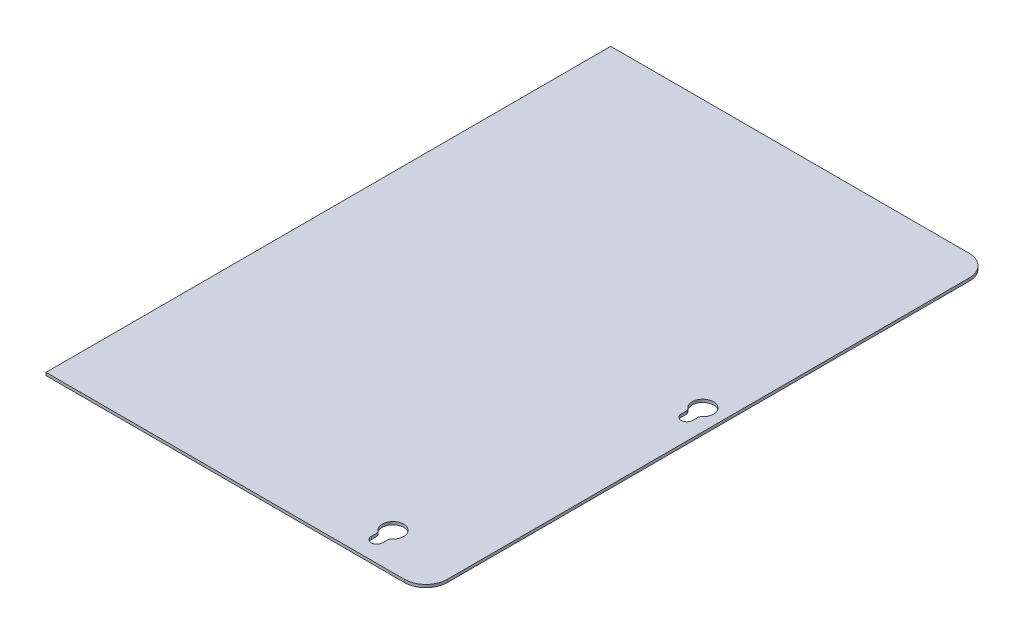
ISO-10303-21;
HEADER;
FILE_DESCRIPTION(('STEP AP214'),'2;1');
FILE_NAME('part.step','',(''),(''),'','','');
FILE_SCHEMA(('AUTOMOTIVE_DESIGN { 1 0 10303 214 1 1 1 1 }'));
ENDSEC;
DATA;
#1=APPLICATION_CONTEXT('core data for automotive mechanical design processes');
#2=APPLICATION_PROTOCOL_DEFINITION('international standard','automotive_design',2000,#1);
#3=PRODUCT_CONTEXT('',#1,'mechanical');
#4=PRODUCT('Part','Part','',(#3));
#5=PRODUCT_RELATED_PRODUCT_CATEGORY('part','',(#4));
#6=PRODUCT_DEFINITION_FORMATION('','',#4);
#7=PRODUCT_DEFINITION_CONTEXT('part definition',#1,'design');
#8=PRODUCT_DEFINITION('design','',#6,#7);
#9=PRODUCT_DEFINITION_SHAPE('','',#8);
#10=(LENGTH_UNIT() NAMED_UNIT(*) SI_UNIT(.MILLI.,.METRE.));
#11=(NAMED_UNIT(*) PLANE_ANGLE_UNIT() SI_UNIT($,.RADIAN.));
#12=(NAMED_UNIT(*) SI_UNIT($,.STERADIAN.) SOLID_ANGLE_UNIT());
#13=UNCERTAINTY_MEASURE_WITH_UNIT(LENGTH_MEASURE(1.E-05),#10,'distance_accuracy_value','');
#14=(GEOMETRIC_REPRESENTATION_CONTEXT(3) GLOBAL_UNCERTAINTY_ASSIGNED_CONTEXT((#13)) GLOBAL_UNIT_ASSIGNED_CONTEXT((#10,
#11,#12)) REPRESENTATION_CONTEXT('',''));
#15=CARTESIAN_POINT('',(0.,0.,0.));
#16=DIRECTION('',(0.,0.,1.));
#17=DIRECTION('',(1.,0.,0.));
#18=AXIS2_PLACEMENT_3D('',#15,#16,#17);
#19=CARTESIAN_POINT('',(139.91438841181,-62.325404639113,-67.8335757825874));
#20=DIRECTION('',(0.,0.,1.));
#21=DIRECTION('',(0.,-1.,0.));
#22=AXIS2_PLACEMENT_3D('',#19,#20,#21);
#23=PLANE('',#22);
#24=DIRECTION('',(1.,0.,0.));
#25=VECTOR('',#24,1.);
#26=CARTESIAN_POINT('',(139.91438841181,-63.655404639113,-67.8335757825874));
#27=LINE('',#26,#25);
#28=CARTESIAN_POINT('',(297.802816543447,-63.6554046391145,-67.8335757825874));
#29=VERTEX_POINT('',#28);
#30=CARTESIAN_POINT('',(130.428149664493,-63.6554046391129,-67.8335757825874));
#31=VERTEX_POINT('',#30);
#32=EDGE_CURVE('E63',#29,#31,#27,.F.);
#33=ORIENTED_EDGE('',*,*,#32,.T.);
#34=DIRECTION('',(0.,1.,0.));
#35=VECTOR('',#34,1.);
#36=CARTESIAN_POINT('',(130.428149664493,-62.3254046391128,-67.8335757825874));
#37=LINE('',#36,#35);
#38=CARTESIAN_POINT('',(130.428149664493,-62.3254046391128,-67.8335757825874));
#39=VERTEX_POINT('',#38);
#40=EDGE_CURVE('E320',#31,#39,#37,.T.);
#41=ORIENTED_EDGE('',*,*,#40,.T.);
#42=DIRECTION('',(-1.,0.,0.));
#43=VECTOR('',#42,1.);
#44=CARTESIAN_POINT('',(192.574388411811,-62.3254046391138,-67.8335757825874));
#45=LINE('',#44,#43);
#46=CARTESIAN_POINT('',(297.802816543447,-62.3254046391145,-67.8335757825874));
#47=VERTEX_POINT('',#46);
#48=EDGE_CURVE('E69',#47,#39,#45,.T.);
#49=ORIENTED_EDGE('',*,*,#48,.F.);
#50=DIRECTION('',(0.,-1.,0.));
#51=VECTOR('',#50,1.);
#52=CARTESIAN_POINT('',(297.802816543447,-62.3254046391145,-67.8335757825874));
#53=LINE('',#52,#51);
#54=EDGE_CURVE('E208',#47,#29,#53,.T.);
#55=ORIENTED_EDGE('',*,*,#54,.T.);
#56=EDGE_LOOP('',(#33,#41,#49,#55));
#57=FACE_BOUND('',#56,.T.);
#58=ADVANCED_FACE('F59',(#57),#23,.F.);
#59=CARTESIAN_POINT('',(192.574388411811,-62.3254046391138,195.847585533979));
#60=DIRECTION('',(0.,0.,-1.));
#61=DIRECTION('',(0.,1.,0.));
#62=AXIS2_PLACEMENT_3D('',#59,#60,#61);
#63=PLANE('',#62);
#64=DIRECTION('',(1.,0.,0.));
#65=VECTOR('',#64,1.);
#66=CARTESIAN_POINT('',(192.574388411811,-62.3254046391138,195.847585533979));
#67=LINE('',#66,#65);
#68=CARTESIAN_POINT('',(130.428149664493,-62.3254046391128,195.847585533979));
#69=VERTEX_POINT('',#68);
#70=CARTESIAN_POINT('',(297.802816543447,-62.3254046391145,195.847585533979));
#71=VERTEX_POINT('',#70);
#72=EDGE_CURVE('E13',#69,#71,#67,.T.);
#73=ORIENTED_EDGE('',*,*,#72,.F.);
#74=DIRECTION('',(0.,1.,0.));
#75=VECTOR('',#74,1.);
#76=CARTESIAN_POINT('',(130.428149664493,-62.3254046391128,195.847585533979));
#77=LINE('',#76,#75);
#78=CARTESIAN_POINT('',(130.428149664493,-63.6554046391129,195.847585533979));
#79=VERTEX_POINT('',#78);
#80=EDGE_CURVE('E212',#79,#69,#77,.T.);
#81=ORIENTED_EDGE('',*,*,#80,.F.);
#82=DIRECTION('',(-1.,0.,0.));
#83=VECTOR('',#82,1.);
#84=CARTESIAN_POINT('',(192.574388411811,-63.6554046391138,195.847585533979));
#85=LINE('',#84,#83);
#86=CARTESIAN_POINT('',(297.802816543447,-63.6554046391145,195.847585533979));
#87=VERTEX_POINT('',#86);
#88=EDGE_CURVE('E78',#79,#87,#85,.F.);
#89=ORIENTED_EDGE('',*,*,#88,.T.);
#90=DIRECTION('',(0.,-1.,0.));
#91=VECTOR('',#90,1.);
#92=CARTESIAN_POINT('',(297.802816543447,-62.3254046391145,195.847585533979));
#93=LINE('',#92,#91);
#94=EDGE_CURVE('E310',#71,#87,#93,.T.);
#95=ORIENTED_EDGE('',*,*,#94,.F.);
#96=EDGE_LOOP('',(#73,#81,#89,#95));
#97=FACE_BOUND('',#96,.T.);
#98=ADVANCED_FACE('F324',(#97),#63,.F.);
#99=CARTESIAN_POINT('',(297.802816543447,-62.3254046391145,-57.8335757825874));
#100=DIRECTION('',(0.,1.,0.));
#101=DIRECTION('',(-1.,0.,0.));
#102=AXIS2_PLACEMENT_3D('',#99,#100,#101);
#103=PLANE('',#102);
#104=ORIENTED_EDGE('',*,*,#48,.T.);
#105=DIRECTION('',(0.,0.,-1.));
#106=VECTOR('',#105,1.);
#107=CARTESIAN_POINT('',(130.428149664493,-62.3254046391128,64.0070048756957));
#108=LINE('',#107,#106);
#109=EDGE_CURVE('E214',#69,#39,#108,.T.);
#110=ORIENTED_EDGE('',*,*,#109,.F.);
#111=ORIENTED_EDGE('',*,*,#72,.T.);
#112=CARTESIAN_POINT('',(297.802816543447,-62.3254046391145,185.847585533979));
#113=DIRECTION('',(0.,1.,0.));
#114=DIRECTION('',(-1.,0.,0.));
#115=AXIS2_PLACEMENT_3D('',#112,#113,#114);
#116=CIRCLE('',#115,10.);
#117=CARTESIAN_POINT('',(307.802816543447,-62.3254046391146,185.847585533979));
#118=VERTEX_POINT('',#117);
#119=EDGE_CURVE('E232',#71,#118,#116,.T.);
#120=ORIENTED_EDGE('',*,*,#119,.T.);
#121=DIRECTION('',(0.,0.,-1.));
#122=VECTOR('',#121,1.);
#123=CARTESIAN_POINT('',(307.802816543447,-62.3254046391146,185.847585533979));
#124=LINE('',#123,#122);
#125=CARTESIAN_POINT('',(307.802816543447,-62.3254046391146,-57.8335757825874));
#126=VERTEX_POINT('',#125);
#127=EDGE_CURVE('E230',#118,#126,#124,.T.);
#128=ORIENTED_EDGE('',*,*,#127,.T.);
#129=CARTESIAN_POINT('',(297.802816543447,-62.3254046391145,-57.8335757825874));
#130=DIRECTION('',(0.,1.,0.));
#131=DIRECTION('',(-1.,0.,0.));
#132=AXIS2_PLACEMENT_3D('',#129,#130,#131);
#133=CIRCLE('',#132,9.99999999999998);
#134=EDGE_CURVE('E228',#126,#47,#133,.T.);
#135=ORIENTED_EDGE('',*,*,#134,.T.);
#136=EDGE_LOOP('',(#104,#110,#111,#120,#128,#135));
#137=FACE_BOUND('',#136,.T.);
#138=CARTESIAN_POINT('',(298.171116543447,-62.3254046391145,56.8753048756958));
#139=DIRECTION('',(0.,1.,0.));
#140=DIRECTION('',(-1.,0.,0.));
#141=AXIS2_PLACEMENT_3D('',#138,#139,#140);
#142=CIRCLE('',#141,4.99999999999999);
#143=CARTESIAN_POINT('',(301.474687972018,-62.3254046391146,60.6284922965857));
#144=VERTEX_POINT('',#143);
#145=CARTESIAN_POINT('',(294.867545114875,-62.3254046391145,60.6284922965857));
#146=VERTEX_POINT('',#145);
#147=EDGE_CURVE('E250',#144,#146,#142,.T.);
#148=ORIENTED_EDGE('',*,*,#147,.F.);
#149=CARTESIAN_POINT('',(302.796116543447,-62.3254046391146,62.1297672649417));
#150=DIRECTION('',(0.,1.,0.));
#151=DIRECTION('',(-1.,0.,0.));
#152=AXIS2_PLACEMENT_3D('',#149,#150,#151);
#153=CIRCLE('',#152,2.);
#154=CARTESIAN_POINT('',(300.796116543447,-62.3254046391146,62.1297672649417));
#155=VERTEX_POINT('',#154);
#156=EDGE_CURVE('E246',#144,#155,#153,.T.);
#157=ORIENTED_EDGE('',*,*,#156,.T.);
#158=DIRECTION('',(0.,0.,-1.));
#159=VECTOR('',#158,1.);
#160=CARTESIAN_POINT('',(300.796116543447,-62.3254046391146,64.0070048756958));
#161=LINE('',#160,#159);
#162=CARTESIAN_POINT('',(300.796116543447,-62.3254046391146,64.3753048756958));
#163=VERTEX_POINT('',#162);
#164=EDGE_CURVE('E265',#163,#155,#161,.T.);
#165=ORIENTED_EDGE('',*,*,#164,.F.);
#166=CARTESIAN_POINT('',(298.171116543447,-62.3254046391145,64.3753048756958));
#167=DIRECTION('',(0.,1.,0.));
#168=DIRECTION('',(-1.,0.,0.));
#169=AXIS2_PLACEMENT_3D('',#166,#167,#168);
#170=CIRCLE('',#169,2.62499999999999);
#171=CARTESIAN_POINT('',(295.546116543447,-62.3254046391145,64.3753048756958));
#172=VERTEX_POINT('',#171);
#173=EDGE_CURVE('E268',#172,#163,#170,.T.);
#174=ORIENTED_EDGE('',*,*,#173,.F.);
#175=DIRECTION('',(0.,0.,-1.));
#176=VECTOR('',#175,1.);
#177=CARTESIAN_POINT('',(295.546116543447,-62.3254046391145,64.0070048756958));
#178=LINE('',#177,#176);
#179=CARTESIAN_POINT('',(295.546116543447,-62.3254046391145,62.1297672649417));
#180=VERTEX_POINT('',#179);
#181=EDGE_CURVE('E243',#172,#180,#178,.T.);
#182=ORIENTED_EDGE('',*,*,#181,.T.);
#183=CARTESIAN_POINT('',(293.546116543447,-62.3254046391145,62.1297672649417));
#184=DIRECTION('',(0.,1.,0.));
#185=DIRECTION('',(-1.,0.,0.));
#186=AXIS2_PLACEMENT_3D('',#183,#184,#185);
#187=CIRCLE('',#186,2.);
#188=EDGE_CURVE('E241',#180,#146,#187,.T.);
#189=ORIENTED_EDGE('',*,*,#188,.T.);
#190=EDGE_LOOP('',(#148,#157,#165,#174,#182,#189));
#191=FACE_BOUND('',#190,.T.);
#192=CARTESIAN_POINT('',(275.302816543447,-62.3254046391144,178.715885533979));
#193=DIRECTION('',(0.,1.,0.));
#194=DIRECTION('',(-1.,0.,0.));
#195=AXIS2_PLACEMENT_3D('',#192,#193,#194);
#196=CIRCLE('',#195,4.99999999999999);
#197=CARTESIAN_POINT('',(278.606387972018,-62.3254046391144,182.469072954869));
#198=VERTEX_POINT('',#197);
#199=CARTESIAN_POINT('',(271.999245114875,-62.3254046391143,182.469072954869));
#200=VERTEX_POINT('',#199);
#201=EDGE_CURVE('E281',#198,#200,#196,.T.);
#202=ORIENTED_EDGE('',*,*,#201,.F.);
#203=CARTESIAN_POINT('',(279.927816543447,-62.3254046391144,183.970347923225));
#204=DIRECTION('',(0.,1.,0.));
#205=DIRECTION('',(-1.,0.,0.));
#206=AXIS2_PLACEMENT_3D('',#203,#204,#205);
#207=CIRCLE('',#206,2.);
#208=CARTESIAN_POINT('',(277.927816543447,-62.3254046391144,183.970347923225));
#209=VERTEX_POINT('',#208);
#210=EDGE_CURVE('E239',#198,#209,#207,.T.);
#211=ORIENTED_EDGE('',*,*,#210,.T.);
#212=DIRECTION('',(0.,0.,-1.));
#213=VECTOR('',#212,1.);
#214=CARTESIAN_POINT('',(277.927816543447,-62.3254046391144,64.0070048756976));
#215=LINE('',#214,#213);
#216=CARTESIAN_POINT('',(277.927816543447,-62.3254046391144,186.215885533979));
#217=VERTEX_POINT('',#216);
#218=EDGE_CURVE('E296',#217,#209,#215,.T.);
#219=ORIENTED_EDGE('',*,*,#218,.F.);
#220=CARTESIAN_POINT('',(275.302816543447,-62.3254046391144,186.215885533979));
#221=DIRECTION('',(0.,1.,0.));
#222=DIRECTION('',(-1.,0.,0.));
#223=AXIS2_PLACEMENT_3D('',#220,#221,#222);
#224=CIRCLE('',#223,2.62499999999999);
#225=CARTESIAN_POINT('',(272.677816543447,-62.3254046391143,186.215885533979));
#226=VERTEX_POINT('',#225);
#227=EDGE_CURVE('E299',#226,#217,#224,.T.);
#228=ORIENTED_EDGE('',*,*,#227,.F.);
#229=DIRECTION('',(0.,0.,-1.));
#230=VECTOR('',#229,1.);
#231=CARTESIAN_POINT('',(272.677816543446,-62.3254046391143,64.0070048756939));
#232=LINE('',#231,#230);
#233=CARTESIAN_POINT('',(272.677816543447,-62.3254046391143,183.970347923225));
#234=VERTEX_POINT('',#233);
#235=EDGE_CURVE('E236',#226,#234,#232,.T.);
#236=ORIENTED_EDGE('',*,*,#235,.T.);
#237=CARTESIAN_POINT('',(270.677816543447,-62.3254046391143,183.970347923225));
#238=DIRECTION('',(0.,1.,0.));
#239=DIRECTION('',(-1.,0.,0.));
#240=AXIS2_PLACEMENT_3D('',#237,#238,#239);
#241=CIRCLE('',#240,2.);
#242=EDGE_CURVE('E234',#234,#200,#241,.T.);
#243=ORIENTED_EDGE('',*,*,#242,.T.);
#244=EDGE_LOOP('',(#202,#211,#219,#228,#236,#243));
#245=FACE_BOUND('',#244,.T.);
#246=ADVANCED_FACE('F61',(#137,#191,#245),#103,.T.);
#247=CARTESIAN_POINT('',(192.574388411811,-63.6554046391138,195.847585533979));
#248=DIRECTION('',(0.,-1.,0.));
#249=DIRECTION('',(1.,0.,0.));
#250=AXIS2_PLACEMENT_3D('',#247,#248,#249);
#251=PLANE('',#250);
#252=ORIENTED_EDGE('',*,*,#88,.F.);
#253=DIRECTION('',(0.,0.,1.));
#254=VECTOR('',#253,1.);
#255=CARTESIAN_POINT('',(130.428149664493,-63.6554046391129,64.0070048756957));
#256=LINE('',#255,#254);
#257=EDGE_CURVE('E203',#79,#31,#256,.F.);
#258=ORIENTED_EDGE('',*,*,#257,.T.);
#259=ORIENTED_EDGE('',*,*,#32,.F.);
#260=CARTESIAN_POINT('',(297.802816543447,-63.6554046391145,-57.8335757825874));
#261=DIRECTION('',(0.,1.,0.));
#262=DIRECTION('',(-1.,0.,0.));
#263=AXIS2_PLACEMENT_3D('',#260,#261,#262);
#264=CIRCLE('',#263,9.99999999999998);
#265=CARTESIAN_POINT('',(307.802816543447,-63.6554046391146,-57.8335757825874));
#266=VERTEX_POINT('',#265);
#267=EDGE_CURVE('E201',#266,#29,#264,.T.);
#268=ORIENTED_EDGE('',*,*,#267,.F.);
#269=DIRECTION('',(0.,0.,-1.));
#270=VECTOR('',#269,1.);
#271=CARTESIAN_POINT('',(307.802816543447,-63.6554046391146,185.847585533979));
#272=LINE('',#271,#270);
#273=CARTESIAN_POINT('',(307.802816543447,-63.6554046391146,185.847585533979));
#274=VERTEX_POINT('',#273);
#275=EDGE_CURVE('E195',#274,#266,#272,.T.);
#276=ORIENTED_EDGE('',*,*,#275,.F.);
#277=CARTESIAN_POINT('',(297.802816543447,-63.6554046391145,185.847585533979));
#278=DIRECTION('',(0.,1.,0.));
#279=DIRECTION('',(-1.,0.,0.));
#280=AXIS2_PLACEMENT_3D('',#277,#278,#279);
#281=CIRCLE('',#280,10.);
#282=EDGE_CURVE('E313',#87,#274,#281,.T.);
#283=ORIENTED_EDGE('',*,*,#282,.F.);
#284=EDGE_LOOP('',(#252,#258,#259,#268,#276,#283));
#285=FACE_BOUND('',#284,.T.);
#286=DIRECTION('',(0.,0.,1.));
#287=VECTOR('',#286,1.);
#288=CARTESIAN_POINT('',(300.796116543447,-63.6554046391146,64.0070048756958));
#289=LINE('',#288,#287);
#290=CARTESIAN_POINT('',(300.796116543447,-63.6554046391146,62.1297672649417));
#291=VERTEX_POINT('',#290);
#292=CARTESIAN_POINT('',(300.796116543447,-63.6554046391145,64.3753048756958));
#293=VERTEX_POINT('',#292);
#294=EDGE_CURVE('E261',#291,#293,#289,.T.);
#295=ORIENTED_EDGE('',*,*,#294,.F.);
#296=CARTESIAN_POINT('',(302.796116543447,-63.6554046391146,62.1297672649417));
#297=DIRECTION('',(0.,1.,0.));
#298=DIRECTION('',(-1.,0.,0.));
#299=AXIS2_PLACEMENT_3D('',#296,#297,#298);
#300=CIRCLE('',#299,2.);
#301=CARTESIAN_POINT('',(301.474687972018,-63.6554046391146,60.6284922965857));
#302=VERTEX_POINT('',#301);
#303=EDGE_CURVE('E226',#291,#302,#300,.F.);
#304=ORIENTED_EDGE('',*,*,#303,.T.);
#305=CARTESIAN_POINT('',(298.171116543447,-63.6554046391145,56.8753048756958));
#306=DIRECTION('',(0.,1.,0.));
#307=DIRECTION('',(-1.,0.,0.));
#308=AXIS2_PLACEMENT_3D('',#305,#306,#307);
#309=CIRCLE('',#308,4.99999999999999);
#310=CARTESIAN_POINT('',(294.867545114875,-63.6554046391145,60.6284922965857));
#311=VERTEX_POINT('',#310);
#312=EDGE_CURVE('E256',#311,#302,#309,.F.);
#313=ORIENTED_EDGE('',*,*,#312,.F.);
#314=CARTESIAN_POINT('',(293.546116543447,-63.6554046391145,62.1297672649417));
#315=DIRECTION('',(0.,1.,0.));
#316=DIRECTION('',(-1.,0.,0.));
#317=AXIS2_PLACEMENT_3D('',#314,#315,#316);
#318=CIRCLE('',#317,2.);
#319=CARTESIAN_POINT('',(295.546116543447,-63.6554046391145,62.1297672649417));
#320=VERTEX_POINT('',#319);
#321=EDGE_CURVE('E224',#311,#320,#318,.F.);
#322=ORIENTED_EDGE('',*,*,#321,.T.);
#323=DIRECTION('',(0.,0.,1.));
#324=VECTOR('',#323,1.);
#325=CARTESIAN_POINT('',(295.546116543447,-63.6554046391145,64.0070048756958));
#326=LINE('',#325,#324);
#327=CARTESIAN_POINT('',(295.546116543447,-63.6554046391145,64.3753048756958));
#328=VERTEX_POINT('',#327);
#329=EDGE_CURVE('E222',#320,#328,#326,.T.);
#330=ORIENTED_EDGE('',*,*,#329,.T.);
#331=CARTESIAN_POINT('',(298.171116543447,-63.6554046391145,64.3753048756958));
#332=DIRECTION('',(0.,1.,0.));
#333=DIRECTION('',(-1.,0.,0.));
#334=AXIS2_PLACEMENT_3D('',#331,#332,#333);
#335=CIRCLE('',#334,2.62499999999999);
#336=EDGE_CURVE('E273',#293,#328,#335,.F.);
#337=ORIENTED_EDGE('',*,*,#336,.F.);
#338=EDGE_LOOP('',(#295,#304,#313,#322,#330,#337));
#339=FACE_BOUND('',#338,.T.);
#340=DIRECTION('',(0.,0.,1.));
#341=VECTOR('',#340,1.);
#342=CARTESIAN_POINT('',(277.927816543447,-63.6554046391144,64.0070048756976));
#343=LINE('',#342,#341);
#344=CARTESIAN_POINT('',(277.927816543447,-63.6554046391144,183.970347923225));
#345=VERTEX_POINT('',#344);
#346=CARTESIAN_POINT('',(277.927816543447,-63.6554046391144,186.215885533979));
#347=VERTEX_POINT('',#346);
#348=EDGE_CURVE('E292',#345,#347,#343,.T.);
#349=ORIENTED_EDGE('',*,*,#348,.F.);
#350=CARTESIAN_POINT('',(279.927816543447,-63.6554046391144,183.970347923225));
#351=DIRECTION('',(0.,1.,0.));
#352=DIRECTION('',(-1.,0.,0.));
#353=AXIS2_PLACEMENT_3D('',#350,#351,#352);
#354=CIRCLE('',#353,2.);
#355=CARTESIAN_POINT('',(278.606387972018,-63.6554046391144,182.469072954869));
#356=VERTEX_POINT('',#355);
#357=EDGE_CURVE('E220',#345,#356,#354,.F.);
#358=ORIENTED_EDGE('',*,*,#357,.T.);
#359=CARTESIAN_POINT('',(275.302816543447,-63.6554046391144,178.715885533979));
#360=DIRECTION('',(0.,1.,0.));
#361=DIRECTION('',(-1.,0.,0.));
#362=AXIS2_PLACEMENT_3D('',#359,#360,#361);
#363=CIRCLE('',#362,4.99999999999999);
#364=CARTESIAN_POINT('',(271.999245114875,-63.6554046391143,182.469072954869));
#365=VERTEX_POINT('',#364);
#366=EDGE_CURVE('E287',#365,#356,#363,.F.);
#367=ORIENTED_EDGE('',*,*,#366,.F.);
#368=CARTESIAN_POINT('',(270.677816543447,-63.6554046391143,183.970347923225));
#369=DIRECTION('',(0.,1.,0.));
#370=DIRECTION('',(-1.,0.,0.));
#371=AXIS2_PLACEMENT_3D('',#368,#369,#370);
#372=CIRCLE('',#371,2.);
#373=CARTESIAN_POINT('',(272.677816543447,-63.6554046391143,183.970347923225));
#374=VERTEX_POINT('',#373);
#375=EDGE_CURVE('E216',#365,#374,#372,.F.);
#376=ORIENTED_EDGE('',*,*,#375,.T.);
#377=DIRECTION('',(0.,0.,1.));
#378=VECTOR('',#377,1.);
#379=CARTESIAN_POINT('',(272.677816543446,-63.6554046391143,64.0070048756939));
#380=LINE('',#379,#378);
#381=CARTESIAN_POINT('',(272.677816543447,-63.6554046391143,186.215885533979));
#382=VERTEX_POINT('',#381);
#383=EDGE_CURVE('E104',#374,#382,#380,.T.);
#384=ORIENTED_EDGE('',*,*,#383,.T.);
#385=CARTESIAN_POINT('',(275.302816543447,-63.6554046391144,186.215885533979));
#386=DIRECTION('',(0.,1.,0.));
#387=DIRECTION('',(-1.,0.,0.));
#388=AXIS2_PLACEMENT_3D('',#385,#386,#387);
#389=CIRCLE('',#388,2.62499999999999);
#390=EDGE_CURVE('E304',#347,#382,#389,.F.);
#391=ORIENTED_EDGE('',*,*,#390,.F.);
#392=EDGE_LOOP('',(#349,#358,#367,#376,#384,#391));
#393=FACE_BOUND('',#392,.T.);
#394=ADVANCED_FACE('F199',(#285,#339,#393),#251,.T.);
#395=CARTESIAN_POINT('',(130.428149664493,-62.3254046391128,64.0070048756957));
#396=DIRECTION('',(1.,0.,0.));
#397=DIRECTION('',(0.,0.,-1.));
#398=AXIS2_PLACEMENT_3D('',#395,#396,#397);
#399=PLANE('',#398);
#400=ORIENTED_EDGE('',*,*,#40,.F.);
#401=ORIENTED_EDGE('',*,*,#257,.F.);
#402=ORIENTED_EDGE('',*,*,#80,.T.);
#403=ORIENTED_EDGE('',*,*,#109,.T.);
#404=EDGE_LOOP('',(#400,#401,#402,#403));
#405=FACE_BOUND('',#404,.T.);
#406=ADVANCED_FACE('F334',(#405),#399,.F.);
#407=CARTESIAN_POINT('',(297.802816543447,-62.3254046391145,-57.8335757825874));
#408=DIRECTION('',(0.,-1.,0.));
#409=DIRECTION('',(1.,0.,0.));
#410=AXIS2_PLACEMENT_3D('',#407,#408,#409);
#411=CYLINDRICAL_SURFACE('',#410,9.99999999999998);
#412=ORIENTED_EDGE('',*,*,#267,.T.);
#413=ORIENTED_EDGE('',*,*,#54,.F.);
#414=ORIENTED_EDGE('',*,*,#134,.F.);
#415=DIRECTION('',(0.,-1.,0.));
#416=VECTOR('',#415,1.);
#417=CARTESIAN_POINT('',(307.802816543447,-62.3254046391146,-57.8335757825874));
#418=LINE('',#417,#416);
#419=EDGE_CURVE('E209',#126,#266,#418,.T.);
#420=ORIENTED_EDGE('',*,*,#419,.T.);
#421=EDGE_LOOP('',(#412,#413,#414,#420));
#422=FACE_BOUND('',#421,.T.);
#423=ADVANCED_FACE('F206',(#422),#411,.T.);
#424=CARTESIAN_POINT('',(307.802816543447,-62.3254046391146,185.847585533979));
#425=DIRECTION('',(-1.,0.,0.));
#426=DIRECTION('',(0.,-1.,0.));
#427=AXIS2_PLACEMENT_3D('',#424,#425,#426);
#428=PLANE('',#427);
#429=ORIENTED_EDGE('',*,*,#275,.T.);
#430=ORIENTED_EDGE('',*,*,#419,.F.);
#431=ORIENTED_EDGE('',*,*,#127,.F.);
#432=DIRECTION('',(0.,-1.,0.));
#433=VECTOR('',#432,1.);
#434=CARTESIAN_POINT('',(307.802816543447,-62.3254046391146,185.847585533979));
#435=LINE('',#434,#433);
#436=EDGE_CURVE('E315',#118,#274,#435,.T.);
#437=ORIENTED_EDGE('',*,*,#436,.T.);
#438=EDGE_LOOP('',(#429,#430,#431,#437));
#439=FACE_BOUND('',#438,.T.);
#440=ADVANCED_FACE('F341',(#439),#428,.F.);
#441=CARTESIAN_POINT('',(297.802816543447,-62.3254046391145,185.847585533979));
#442=DIRECTION('',(0.,-1.,0.));
#443=DIRECTION('',(1.,0.,0.));
#444=AXIS2_PLACEMENT_3D('',#441,#442,#443);
#445=CYLINDRICAL_SURFACE('',#444,10.);
#446=ORIENTED_EDGE('',*,*,#282,.T.);
#447=ORIENTED_EDGE('',*,*,#436,.F.);
#448=ORIENTED_EDGE('',*,*,#119,.F.);
#449=ORIENTED_EDGE('',*,*,#94,.T.);
#450=EDGE_LOOP('',(#446,#447,#448,#449));
#451=FACE_BOUND('',#450,.T.);
#452=ADVANCED_FACE('F327',(#451),#445,.T.);
#453=CARTESIAN_POINT('',(270.677816543446,-116.316404639115,183.970347923225));
#454=DIRECTION('',(0.,1.,0.));
#455=DIRECTION('',(-1.,0.,0.));
#456=AXIS2_PLACEMENT_3D('',#453,#454,#455);
#457=CYLINDRICAL_SURFACE('',#456,2.);
#458=ORIENTED_EDGE('',*,*,#375,.F.);
#459=DIRECTION('',(0.,1.,0.));
#460=VECTOR('',#459,1.);
#461=CARTESIAN_POINT('',(271.999245114875,-116.316404639115,182.469072954869));
#462=LINE('',#461,#460);
#463=EDGE_CURVE('E279',#200,#365,#462,.F.);
#464=ORIENTED_EDGE('',*,*,#463,.F.);
#465=ORIENTED_EDGE('',*,*,#242,.F.);
#466=DIRECTION('',(0.,-1.,0.));
#467=VECTOR('',#466,1.);
#468=CARTESIAN_POINT('',(272.677816543447,-62.3254046391143,183.970347923225));
#469=LINE('',#468,#467);
#470=EDGE_CURVE('E307',#374,#234,#469,.F.);
#471=ORIENTED_EDGE('',*,*,#470,.F.);
#472=EDGE_LOOP('',(#458,#464,#465,#471));
#473=FACE_BOUND('',#472,.T.);
#474=ADVANCED_FACE('F391',(#473),#457,.T.);
#475=CARTESIAN_POINT('',(272.677816543445,-116.316404639115,64.0070048756939));
#476=DIRECTION('',(1.,0.,0.));
#477=DIRECTION('',(0.,0.,-1.));
#478=AXIS2_PLACEMENT_3D('',#475,#476,#477);
#479=PLANE('',#478);
#480=ORIENTED_EDGE('',*,*,#383,.F.);
#481=ORIENTED_EDGE('',*,*,#470,.T.);
#482=ORIENTED_EDGE('',*,*,#235,.F.);
#483=DIRECTION('',(0.,1.,0.));
#484=VECTOR('',#483,1.);
#485=CARTESIAN_POINT('',(272.677816543446,-116.316404639115,186.215885533979));
#486=LINE('',#485,#484);
#487=EDGE_CURVE('E302',#382,#226,#486,.T.);
#488=ORIENTED_EDGE('',*,*,#487,.F.);
#489=EDGE_LOOP('',(#480,#481,#482,#488));
#490=FACE_BOUND('',#489,.T.);
#491=ADVANCED_FACE('F401',(#490),#479,.T.);
#492=CARTESIAN_POINT('',(275.302816543446,-116.316404639115,186.215885533979));
#493=DIRECTION('',(0.,1.,0.));
#494=DIRECTION('',(-1.,0.,0.));
#495=AXIS2_PLACEMENT_3D('',#492,#493,#494);
#496=CYLINDRICAL_SURFACE('',#495,2.62499999999999);
#497=ORIENTED_EDGE('',*,*,#390,.T.);
#498=ORIENTED_EDGE('',*,*,#487,.T.);
#499=ORIENTED_EDGE('',*,*,#227,.T.);
#500=DIRECTION('',(0.,1.,0.));
#501=VECTOR('',#500,1.);
#502=CARTESIAN_POINT('',(277.927816543446,-116.316404639115,186.215885533979));
#503=LINE('',#502,#501);
#504=EDGE_CURVE('E290',#347,#217,#503,.T.);
#505=ORIENTED_EDGE('',*,*,#504,.F.);
#506=EDGE_LOOP('',(#497,#498,#499,#505));
#507=FACE_BOUND('',#506,.T.);
#508=ADVANCED_FACE('F411',(#507),#496,.F.);
#509=CARTESIAN_POINT('',(277.927816543447,-116.316404639115,64.0070048756976));
#510=DIRECTION('',(1.,0.,0.));
#511=DIRECTION('',(0.,0.,-1.));
#512=AXIS2_PLACEMENT_3D('',#509,#510,#511);
#513=PLANE('',#512);
#514=ORIENTED_EDGE('',*,*,#218,.T.);
#515=DIRECTION('',(0.,1.,0.));
#516=VECTOR('',#515,1.);
#517=CARTESIAN_POINT('',(277.927816543446,-116.316404639115,183.970347923225));
#518=LINE('',#517,#516);
#519=EDGE_CURVE('E294',#209,#345,#518,.F.);
#520=ORIENTED_EDGE('',*,*,#519,.T.);
#521=ORIENTED_EDGE('',*,*,#348,.T.);
#522=ORIENTED_EDGE('',*,*,#504,.T.);
#523=EDGE_LOOP('',(#514,#520,#521,#522));
#524=FACE_BOUND('',#523,.T.);
#525=ADVANCED_FACE('F422',(#524),#513,.F.);
#526=CARTESIAN_POINT('',(279.927816543446,-116.316404639115,183.970347923225));
#527=DIRECTION('',(0.,1.,0.));
#528=DIRECTION('',(-1.,0.,0.));
#529=AXIS2_PLACEMENT_3D('',#526,#527,#528);
#530=CYLINDRICAL_SURFACE('',#529,2.);
#531=ORIENTED_EDGE('',*,*,#357,.F.);
#532=ORIENTED_EDGE('',*,*,#519,.F.);
#533=ORIENTED_EDGE('',*,*,#210,.F.);
#534=DIRECTION('',(0.,1.,0.));
#535=VECTOR('',#534,1.);
#536=CARTESIAN_POINT('',(278.606387972018,-116.316404639115,182.469072954869));
#537=LINE('',#536,#535);
#538=EDGE_CURVE('E284',#356,#198,#537,.T.);
#539=ORIENTED_EDGE('',*,*,#538,.F.);
#540=EDGE_LOOP('',(#531,#532,#533,#539));
#541=FACE_BOUND('',#540,.T.);
#542=ADVANCED_FACE('F433',(#541),#530,.T.);
#543=CARTESIAN_POINT('',(275.302816543446,-116.316404639115,178.715885533979));
#544=DIRECTION('',(0.,1.,0.));
#545=DIRECTION('',(-1.,0.,0.));
#546=AXIS2_PLACEMENT_3D('',#543,#544,#545);
#547=CYLINDRICAL_SURFACE('',#546,4.99999999999999);
#548=ORIENTED_EDGE('',*,*,#366,.T.);
#549=ORIENTED_EDGE('',*,*,#538,.T.);
#550=ORIENTED_EDGE('',*,*,#201,.T.);
#551=ORIENTED_EDGE('',*,*,#463,.T.);
#552=EDGE_LOOP('',(#548,#549,#550,#551));
#553=FACE_BOUND('',#552,.T.);
#554=ADVANCED_FACE('F444',(#553),#547,.F.);
#555=CARTESIAN_POINT('',(293.546116543446,-116.316404639115,62.1297672649417));
#556=DIRECTION('',(0.,1.,0.));
#557=DIRECTION('',(-1.,0.,0.));
#558=AXIS2_PLACEMENT_3D('',#555,#556,#557);
#559=CYLINDRICAL_SURFACE('',#558,2.);
#560=ORIENTED_EDGE('',*,*,#321,.F.);
#561=DIRECTION('',(0.,1.,0.));
#562=VECTOR('',#561,1.);
#563=CARTESIAN_POINT('',(294.867545114875,-116.316404639115,60.6284922965857));
#564=LINE('',#563,#562);
#565=EDGE_CURVE('E248',#146,#311,#564,.F.);
#566=ORIENTED_EDGE('',*,*,#565,.F.);
#567=ORIENTED_EDGE('',*,*,#188,.F.);
#568=DIRECTION('',(0.,-1.,0.));
#569=VECTOR('',#568,1.);
#570=CARTESIAN_POINT('',(295.546116543447,-62.3254046391145,62.1297672649417));
#571=LINE('',#570,#569);
#572=EDGE_CURVE('E276',#320,#180,#571,.F.);
#573=ORIENTED_EDGE('',*,*,#572,.F.);
#574=EDGE_LOOP('',(#560,#566,#567,#573));
#575=FACE_BOUND('',#574,.T.);
#576=ADVANCED_FACE('F454',(#575),#559,.T.);
#577=CARTESIAN_POINT('',(295.546116543446,-116.316404639115,64.0070048756958));
#578=DIRECTION('',(1.,0.,0.));
#579=DIRECTION('',(0.,1.,0.));
#580=AXIS2_PLACEMENT_3D('',#577,#578,#579);
#581=PLANE('',#580);
#582=ORIENTED_EDGE('',*,*,#329,.F.);
#583=ORIENTED_EDGE('',*,*,#572,.T.);
#584=ORIENTED_EDGE('',*,*,#181,.F.);
#585=DIRECTION('',(0.,1.,0.));
#586=VECTOR('',#585,1.);
#587=CARTESIAN_POINT('',(295.546116543446,-116.316404639115,64.3753048756958));
#588=LINE('',#587,#586);
#589=EDGE_CURVE('E271',#328,#172,#588,.T.);
#590=ORIENTED_EDGE('',*,*,#589,.F.);
#591=EDGE_LOOP('',(#582,#583,#584,#590));
#592=FACE_BOUND('',#591,.T.);
#593=ADVANCED_FACE('F465',(#592),#581,.T.);
#594=CARTESIAN_POINT('',(298.171116543446,-116.316404639115,64.3753048756958));
#595=DIRECTION('',(0.,1.,0.));
#596=DIRECTION('',(-1.,0.,0.));
#597=AXIS2_PLACEMENT_3D('',#594,#595,#596);
#598=CYLINDRICAL_SURFACE('',#597,2.62499999999999);
#599=ORIENTED_EDGE('',*,*,#336,.T.);
#600=ORIENTED_EDGE('',*,*,#589,.T.);
#601=ORIENTED_EDGE('',*,*,#173,.T.);
#602=DIRECTION('',(0.,1.,0.));
#603=VECTOR('',#602,1.);
#604=CARTESIAN_POINT('',(300.796116543446,-116.316404639115,64.3753048756958));
#605=LINE('',#604,#603);
#606=EDGE_CURVE('E259',#293,#163,#605,.T.);
#607=ORIENTED_EDGE('',*,*,#606,.F.);
#608=EDGE_LOOP('',(#599,#600,#601,#607));
#609=FACE_BOUND('',#608,.T.);
#610=ADVANCED_FACE('F475',(#609),#598,.F.);
#611=CARTESIAN_POINT('',(300.796116543446,-116.316404639115,64.0070048756958));
#612=DIRECTION('',(1.,0.,0.));
#613=DIRECTION('',(0.,1.,0.));
#614=AXIS2_PLACEMENT_3D('',#611,#612,#613);
#615=PLANE('',#614);
#616=ORIENTED_EDGE('',*,*,#164,.T.);
#617=DIRECTION('',(0.,1.,0.));
#618=VECTOR('',#617,1.);
#619=CARTESIAN_POINT('',(300.796116543446,-116.316404639115,62.1297672649417));
#620=LINE('',#619,#618);
#621=EDGE_CURVE('E263',#155,#291,#620,.F.);
#622=ORIENTED_EDGE('',*,*,#621,.T.);
#623=ORIENTED_EDGE('',*,*,#294,.T.);
#624=ORIENTED_EDGE('',*,*,#606,.T.);
#625=EDGE_LOOP('',(#616,#622,#623,#624));
#626=FACE_BOUND('',#625,.T.);
#627=ADVANCED_FACE('F486',(#626),#615,.F.);
#628=CARTESIAN_POINT('',(302.796116543446,-116.316404639115,62.1297672649417));
#629=DIRECTION('',(0.,1.,0.));
#630=DIRECTION('',(-1.,0.,0.));
#631=AXIS2_PLACEMENT_3D('',#628,#629,#630);
#632=CYLINDRICAL_SURFACE('',#631,2.);
#633=ORIENTED_EDGE('',*,*,#303,.F.);
#634=ORIENTED_EDGE('',*,*,#621,.F.);
#635=ORIENTED_EDGE('',*,*,#156,.F.);
#636=DIRECTION('',(0.,1.,0.));
#637=VECTOR('',#636,1.);
#638=CARTESIAN_POINT('',(301.474687972018,-116.316404639115,60.6284922965857));
#639=LINE('',#638,#637);
#640=EDGE_CURVE('E253',#302,#144,#639,.T.);
#641=ORIENTED_EDGE('',*,*,#640,.F.);
#642=EDGE_LOOP('',(#633,#634,#635,#641));
#643=FACE_BOUND('',#642,.T.);
#644=ADVANCED_FACE('F497',(#643),#632,.T.);
#645=CARTESIAN_POINT('',(298.171116543446,-116.316404639115,56.8753048756958));
#646=DIRECTION('',(0.,1.,0.));
#647=DIRECTION('',(-1.,0.,0.));
#648=AXIS2_PLACEMENT_3D('',#645,#646,#647);
#649=CYLINDRICAL_SURFACE('',#648,4.99999999999999);
#650=ORIENTED_EDGE('',*,*,#312,.T.);
#651=ORIENTED_EDGE('',*,*,#640,.T.);
#652=ORIENTED_EDGE('',*,*,#147,.T.);
#653=ORIENTED_EDGE('',*,*,#565,.T.);
#654=EDGE_LOOP('',(#650,#651,#652,#653));
#655=FACE_BOUND('',#654,.T.);
#656=ADVANCED_FACE('F508',(#655),#649,.F.);
#657=CLOSED_SHELL('',(#58,#98,#246,#394,#406,#423,#440,#452,#474,#491,#508,#525,#542,#554,#576,
#593,#610,#627,#644,#656));
#658=MANIFOLD_SOLID_BREP('B2',#657);
#659=ADVANCED_BREP_SHAPE_REPRESENTATION('',(#18,#658),#14);
#660=SHAPE_DEFINITION_REPRESENTATION(#9,#659);
ENDSEC;
END-ISO-10303-21;
